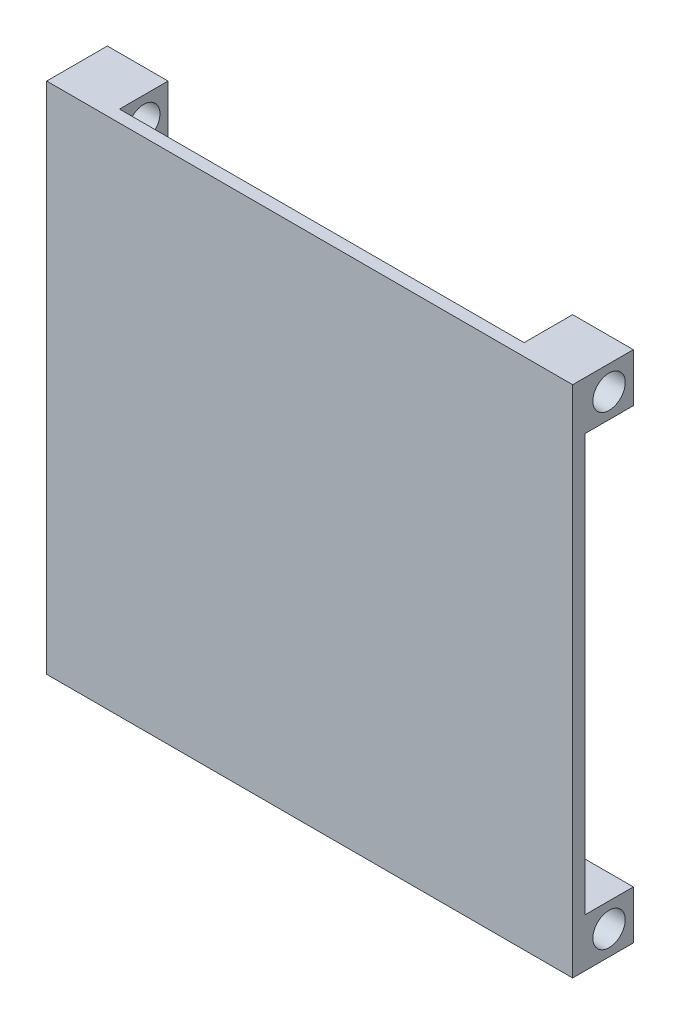
ISO-10303-21;
HEADER;
FILE_DESCRIPTION(('STEP AP214'),'2;1');
FILE_NAME('part.step','',(''),(''),'','','');
FILE_SCHEMA(('AUTOMOTIVE_DESIGN { 1 0 10303 214 1 1 1 1 }'));
ENDSEC;
DATA;
#1=APPLICATION_CONTEXT('core data for automotive mechanical design processes');
#2=APPLICATION_PROTOCOL_DEFINITION('international standard','automotive_design',2000,#1);
#3=PRODUCT_CONTEXT('',#1,'mechanical');
#4=PRODUCT('Part','Part','',(#3));
#5=PRODUCT_RELATED_PRODUCT_CATEGORY('part','',(#4));
#6=PRODUCT_DEFINITION_FORMATION('','',#4);
#7=PRODUCT_DEFINITION_CONTEXT('part definition',#1,'design');
#8=PRODUCT_DEFINITION('design','',#6,#7);
#9=PRODUCT_DEFINITION_SHAPE('','',#8);
#10=(LENGTH_UNIT() NAMED_UNIT(*) SI_UNIT(.MILLI.,.METRE.));
#11=(NAMED_UNIT(*) PLANE_ANGLE_UNIT() SI_UNIT($,.RADIAN.));
#12=(NAMED_UNIT(*) SI_UNIT($,.STERADIAN.) SOLID_ANGLE_UNIT());
#13=UNCERTAINTY_MEASURE_WITH_UNIT(LENGTH_MEASURE(1.E-05),#10,'distance_accuracy_value','');
#14=(GEOMETRIC_REPRESENTATION_CONTEXT(3) GLOBAL_UNCERTAINTY_ASSIGNED_CONTEXT((#13)) GLOBAL_UNIT_ASSIGNED_CONTEXT((#10,
#11,#12)) REPRESENTATION_CONTEXT('',''));
#15=CARTESIAN_POINT('',(0.,0.,0.));
#16=DIRECTION('',(0.,0.,1.));
#17=DIRECTION('',(1.,0.,0.));
#18=AXIS2_PLACEMENT_3D('',#15,#16,#17);
#19=CARTESIAN_POINT('',(-130.,127.,-12.));
#20=DIRECTION('',(0.,0.,-1.));
#21=DIRECTION('',(0.,1.,0.));
#22=AXIS2_PLACEMENT_3D('',#19,#20,#21);
#23=PLANE('',#22);
#24=DIRECTION('',(0.,1.,0.));
#25=VECTOR('',#24,1.);
#26=CARTESIAN_POINT('',(-115.,-33.,-12.));
#27=LINE('',#26,#25);
#28=CARTESIAN_POINT('',(-115.,115.,-12.));
#29=VERTEX_POINT('',#28);
#30=CARTESIAN_POINT('',(-115.,127.,-12.));
#31=VERTEX_POINT('',#30);
#32=EDGE_CURVE('E167',#29,#31,#27,.T.);
#33=ORIENTED_EDGE('',*,*,#32,.F.);
#34=DIRECTION('',(1.,0.,0.));
#35=VECTOR('',#34,1.);
#36=CARTESIAN_POINT('',(-130.,115.,-12.));
#37=LINE('',#36,#35);
#38=CARTESIAN_POINT('',(-130.,115.,-12.));
#39=VERTEX_POINT('',#38);
#40=EDGE_CURVE('E256',#39,#29,#37,.T.);
#41=ORIENTED_EDGE('',*,*,#40,.F.);
#42=DIRECTION('',(0.,1.,0.));
#43=VECTOR('',#42,1.);
#44=CARTESIAN_POINT('',(-130.,127.,-12.));
#45=LINE('',#44,#43);
#46=CARTESIAN_POINT('',(-130.,127.,-12.));
#47=VERTEX_POINT('',#46);
#48=EDGE_CURVE('E245',#39,#47,#45,.T.);
#49=ORIENTED_EDGE('',*,*,#48,.T.);
#50=DIRECTION('',(1.,0.,0.));
#51=VECTOR('',#50,1.);
#52=CARTESIAN_POINT('',(-130.,127.,-12.));
#53=LINE('',#52,#51);
#54=EDGE_CURVE('E252',#47,#31,#53,.T.);
#55=ORIENTED_EDGE('',*,*,#54,.T.);
#56=EDGE_LOOP('',(#33,#41,#49,#55));
#57=FACE_BOUND('',#56,.T.);
#58=ADVANCED_FACE('F34',(#57),#23,.T.);
#59=CARTESIAN_POINT('',(-130.,115.,0.));
#60=DIRECTION('',(0.,-1.,0.));
#61=DIRECTION('',(0.,0.,-1.));
#62=AXIS2_PLACEMENT_3D('',#59,#60,#61);
#63=PLANE('',#62);
#64=DIRECTION('',(0.,0.,-1.));
#65=VECTOR('',#64,1.);
#66=CARTESIAN_POINT('',(-115.,115.,0.));
#67=LINE('',#66,#65);
#68=CARTESIAN_POINT('',(-115.,115.,0.));
#69=VERTEX_POINT('',#68);
#70=EDGE_CURVE('E201',#69,#29,#67,.T.);
#71=ORIENTED_EDGE('',*,*,#70,.F.);
#72=DIRECTION('',(1.,0.,0.));
#73=VECTOR('',#72,1.);
#74=CARTESIAN_POINT('',(-130.,115.,0.));
#75=LINE('',#74,#73);
#76=CARTESIAN_POINT('',(-130.,115.,0.));
#77=VERTEX_POINT('',#76);
#78=EDGE_CURVE('E156',#77,#69,#75,.T.);
#79=ORIENTED_EDGE('',*,*,#78,.F.);
#80=DIRECTION('',(0.,0.,-1.));
#81=VECTOR('',#80,1.);
#82=CARTESIAN_POINT('',(-130.,115.,0.));
#83=LINE('',#82,#81);
#84=EDGE_CURVE('E248',#77,#39,#83,.T.);
#85=ORIENTED_EDGE('',*,*,#84,.T.);
#86=ORIENTED_EDGE('',*,*,#40,.T.);
#87=EDGE_LOOP('',(#71,#79,#85,#86));
#88=FACE_BOUND('',#87,.T.);
#89=ADVANCED_FACE('F325',(#88),#63,.T.);
#90=CARTESIAN_POINT('',(-130.,121.,-6.));
#91=DIRECTION('',(1.,0.,0.));
#92=DIRECTION('',(0.,0.,-1.));
#93=AXIS2_PLACEMENT_3D('',#90,#91,#92);
#94=CYLINDRICAL_SURFACE('',#93,4.00000000000001);
#95=CARTESIAN_POINT('',(-115.,121.,-6.));
#96=DIRECTION('',(-1.,0.,0.));
#97=DIRECTION('',(0.,0.,1.));
#98=AXIS2_PLACEMENT_3D('',#95,#96,#97);
#99=CIRCLE('',#98,4.00000000000001);
#100=CARTESIAN_POINT('',(-115.,121.,-1.99999999999999));
#101=VERTEX_POINT('',#100);
#102=EDGE_CURVE('E198',#101,#101,#99,.F.);
#103=ORIENTED_EDGE('',*,*,#102,.T.);
#104=EDGE_LOOP('',(#103));
#105=FACE_BOUND('',#104,.T.);
#106=CARTESIAN_POINT('',(-130.,121.,-6.));
#107=DIRECTION('',(1.,0.,0.));
#108=DIRECTION('',(0.,0.,-1.));
#109=AXIS2_PLACEMENT_3D('',#106,#107,#108);
#110=CIRCLE('',#109,4.00000000000001);
#111=CARTESIAN_POINT('',(-130.,121.,-10.));
#112=VERTEX_POINT('',#111);
#113=EDGE_CURVE('E239',#112,#112,#110,.T.);
#114=ORIENTED_EDGE('',*,*,#113,.F.);
#115=EDGE_LOOP('',(#114));
#116=FACE_BOUND('',#115,.T.);
#117=ADVANCED_FACE('F375',(#105,#116),#94,.F.);
#118=CARTESIAN_POINT('',(-130.,12.,0.));
#119=DIRECTION('',(0.,1.,0.));
#120=DIRECTION('',(0.,0.,1.));
#121=AXIS2_PLACEMENT_3D('',#118,#119,#120);
#122=PLANE('',#121);
#123=DIRECTION('',(0.,0.,1.));
#124=VECTOR('',#123,1.);
#125=CARTESIAN_POINT('',(-115.,12.,0.));
#126=LINE('',#125,#124);
#127=CARTESIAN_POINT('',(-115.,12.,-12.));
#128=VERTEX_POINT('',#127);
#129=CARTESIAN_POINT('',(-115.,12.,0.));
#130=VERTEX_POINT('',#129);
#131=EDGE_CURVE('E196',#128,#130,#126,.T.);
#132=ORIENTED_EDGE('',*,*,#131,.F.);
#133=DIRECTION('',(1.,0.,0.));
#134=VECTOR('',#133,1.);
#135=CARTESIAN_POINT('',(-130.,12.,-12.));
#136=LINE('',#135,#134);
#137=CARTESIAN_POINT('',(-130.,12.,-12.));
#138=VERTEX_POINT('',#137);
#139=EDGE_CURVE('E232',#138,#128,#136,.T.);
#140=ORIENTED_EDGE('',*,*,#139,.F.);
#141=DIRECTION('',(0.,0.,1.));
#142=VECTOR('',#141,1.);
#143=CARTESIAN_POINT('',(-130.,12.,0.));
#144=LINE('',#143,#142);
#145=CARTESIAN_POINT('',(-130.,12.,0.));
#146=VERTEX_POINT('',#145);
#147=EDGE_CURVE('E219',#138,#146,#144,.T.);
#148=ORIENTED_EDGE('',*,*,#147,.T.);
#149=DIRECTION('',(1.,0.,0.));
#150=VECTOR('',#149,1.);
#151=CARTESIAN_POINT('',(-130.,12.,0.));
#152=LINE('',#151,#150);
#153=EDGE_CURVE('E227',#146,#130,#152,.T.);
#154=ORIENTED_EDGE('',*,*,#153,.T.);
#155=EDGE_LOOP('',(#132,#140,#148,#154));
#156=FACE_BOUND('',#155,.T.);
#157=ADVANCED_FACE('F332',(#156),#122,.T.);
#158=CARTESIAN_POINT('',(-130.,0.,-12.));
#159=DIRECTION('',(0.,0.,-1.));
#160=DIRECTION('',(0.,1.,0.));
#161=AXIS2_PLACEMENT_3D('',#158,#159,#160);
#162=PLANE('',#161);
#163=CARTESIAN_POINT('',(-115.,0.,-12.));
#164=VERTEX_POINT('',#163);
#165=EDGE_CURVE('E178',#164,#128,#27,.T.);
#166=ORIENTED_EDGE('',*,*,#165,.F.);
#167=DIRECTION('',(1.,0.,0.));
#168=VECTOR('',#167,1.);
#169=CARTESIAN_POINT('',(-130.,0.,-12.));
#170=LINE('',#169,#168);
#171=CARTESIAN_POINT('',(-130.,0.,-12.));
#172=VERTEX_POINT('',#171);
#173=EDGE_CURVE('E236',#172,#164,#170,.T.);
#174=ORIENTED_EDGE('',*,*,#173,.F.);
#175=DIRECTION('',(0.,1.,0.));
#176=VECTOR('',#175,1.);
#177=CARTESIAN_POINT('',(-130.,0.,-12.));
#178=LINE('',#177,#176);
#179=EDGE_CURVE('E216',#172,#138,#178,.T.);
#180=ORIENTED_EDGE('',*,*,#179,.T.);
#181=ORIENTED_EDGE('',*,*,#139,.T.);
#182=EDGE_LOOP('',(#166,#174,#180,#181));
#183=FACE_BOUND('',#182,.T.);
#184=ADVANCED_FACE('F336',(#183),#162,.T.);
#185=CARTESIAN_POINT('',(-130.,6.00000000000001,-6.));
#186=DIRECTION('',(1.,0.,0.));
#187=DIRECTION('',(0.,0.,-1.));
#188=AXIS2_PLACEMENT_3D('',#185,#186,#187);
#189=CYLINDRICAL_SURFACE('',#188,4.);
#190=CARTESIAN_POINT('',(-115.,6.00000000000001,-6.));
#191=DIRECTION('',(-1.,0.,0.));
#192=DIRECTION('',(0.,0.,1.));
#193=AXIS2_PLACEMENT_3D('',#190,#191,#192);
#194=CIRCLE('',#193,4.);
#195=CARTESIAN_POINT('',(-115.,6.00000000000001,-2.));
#196=VERTEX_POINT('',#195);
#197=EDGE_CURVE('E195',#196,#196,#194,.F.);
#198=ORIENTED_EDGE('',*,*,#197,.T.);
#199=EDGE_LOOP('',(#198));
#200=FACE_BOUND('',#199,.T.);
#201=CARTESIAN_POINT('',(-130.,6.00000000000001,-6.));
#202=DIRECTION('',(1.,0.,0.));
#203=DIRECTION('',(0.,0.,1.));
#204=AXIS2_PLACEMENT_3D('',#201,#202,#203);
#205=CIRCLE('',#204,4.);
#206=CARTESIAN_POINT('',(-130.,6.00000000000001,-2.));
#207=VERTEX_POINT('',#206);
#208=EDGE_CURVE('E210',#207,#207,#205,.T.);
#209=ORIENTED_EDGE('',*,*,#208,.F.);
#210=EDGE_LOOP('',(#209));
#211=FACE_BOUND('',#210,.T.);
#212=ADVANCED_FACE('F365',(#200,#211),#189,.F.);
#213=CARTESIAN_POINT('',(0.,0.,3.));
#214=DIRECTION('',(-1.,0.,0.));
#215=DIRECTION('',(0.,0.,1.));
#216=AXIS2_PLACEMENT_3D('',#213,#214,#215);
#217=PLANE('',#216);
#218=DIRECTION('',(0.,0.,-1.));
#219=VECTOR('',#218,1.);
#220=CARTESIAN_POINT('',(0.,0.,3.));
#221=LINE('',#220,#219);
#222=CARTESIAN_POINT('',(0.,0.,3.));
#223=VERTEX_POINT('',#222);
#224=CARTESIAN_POINT('',(0.,0.,-12.));
#225=VERTEX_POINT('',#224);
#226=EDGE_CURVE('E284',#223,#225,#221,.T.);
#227=ORIENTED_EDGE('',*,*,#226,.T.);
#228=DIRECTION('',(0.,1.,0.));
#229=VECTOR('',#228,1.);
#230=CARTESIAN_POINT('',(0.,0.,-12.));
#231=LINE('',#230,#229);
#232=CARTESIAN_POINT('',(0.,12.,-12.));
#233=VERTEX_POINT('',#232);
#234=EDGE_CURVE('E213',#225,#233,#231,.T.);
#235=ORIENTED_EDGE('',*,*,#234,.T.);
#236=DIRECTION('',(0.,0.,1.));
#237=VECTOR('',#236,1.);
#238=CARTESIAN_POINT('',(0.,12.,0.));
#239=LINE('',#238,#237);
#240=CARTESIAN_POINT('',(0.,12.,0.));
#241=VERTEX_POINT('',#240);
#242=EDGE_CURVE('E220',#233,#241,#239,.T.);
#243=ORIENTED_EDGE('',*,*,#242,.T.);
#244=DIRECTION('',(0.,1.,0.));
#245=VECTOR('',#244,1.);
#246=CARTESIAN_POINT('',(0.,0.,0.));
#247=LINE('',#246,#245);
#248=CARTESIAN_POINT('',(0.,115.,0.));
#249=VERTEX_POINT('',#248);
#250=EDGE_CURVE('E254',#241,#249,#247,.T.);
#251=ORIENTED_EDGE('',*,*,#250,.T.);
#252=DIRECTION('',(0.,0.,-1.));
#253=VECTOR('',#252,1.);
#254=CARTESIAN_POINT('',(0.,115.,0.));
#255=LINE('',#254,#253);
#256=CARTESIAN_POINT('',(0.,115.,-12.));
#257=VERTEX_POINT('',#256);
#258=EDGE_CURVE('E242',#249,#257,#255,.T.);
#259=ORIENTED_EDGE('',*,*,#258,.T.);
#260=DIRECTION('',(0.,1.,0.));
#261=VECTOR('',#260,1.);
#262=CARTESIAN_POINT('',(0.,127.,-12.));
#263=LINE('',#262,#261);
#264=CARTESIAN_POINT('',(0.,127.,-12.));
#265=VERTEX_POINT('',#264);
#266=EDGE_CURVE('E249',#257,#265,#263,.T.);
#267=ORIENTED_EDGE('',*,*,#266,.T.);
#268=DIRECTION('',(0.,0.,-1.));
#269=VECTOR('',#268,1.);
#270=CARTESIAN_POINT('',(0.,127.,3.));
#271=LINE('',#270,#269);
#272=CARTESIAN_POINT('',(0.,127.,3.));
#273=VERTEX_POINT('',#272);
#274=EDGE_CURVE('E12',#273,#265,#271,.T.);
#275=ORIENTED_EDGE('',*,*,#274,.F.);
#276=DIRECTION('',(0.,1.,0.));
#277=VECTOR('',#276,1.);
#278=CARTESIAN_POINT('',(0.,0.,3.));
#279=LINE('',#278,#277);
#280=EDGE_CURVE('E261',#223,#273,#279,.T.);
#281=ORIENTED_EDGE('',*,*,#280,.F.);
#282=EDGE_LOOP('',(#227,#235,#243,#251,#259,#267,#275,#281));
#283=FACE_BOUND('',#282,.T.);
#284=CARTESIAN_POINT('',(0.,121.,-6.));
#285=DIRECTION('',(1.,0.,0.));
#286=DIRECTION('',(0.,0.,-1.));
#287=AXIS2_PLACEMENT_3D('',#284,#285,#286);
#288=CIRCLE('',#287,4.00000000000001);
#289=CARTESIAN_POINT('',(0.,121.,-10.));
#290=VERTEX_POINT('',#289);
#291=EDGE_CURVE('E230',#290,#290,#288,.T.);
#292=ORIENTED_EDGE('',*,*,#291,.F.);
#293=EDGE_LOOP('',(#292));
#294=FACE_BOUND('',#293,.T.);
#295=CARTESIAN_POINT('',(0.,6.00000000000001,-6.));
#296=DIRECTION('',(1.,0.,0.));
#297=DIRECTION('',(0.,0.,1.));
#298=AXIS2_PLACEMENT_3D('',#295,#296,#297);
#299=CIRCLE('',#298,4.);
#300=CARTESIAN_POINT('',(0.,6.00000000000001,-2.));
#301=VERTEX_POINT('',#300);
#302=EDGE_CURVE('E209',#301,#301,#299,.T.);
#303=ORIENTED_EDGE('',*,*,#302,.F.);
#304=EDGE_LOOP('',(#303));
#305=FACE_BOUND('',#304,.T.);
#306=ADVANCED_FACE('F36',(#283,#294,#305),#217,.F.);
#307=CARTESIAN_POINT('',(0.,127.,3.));
#308=DIRECTION('',(0.,-1.,0.));
#309=DIRECTION('',(1.,0.,0.));
#310=AXIS2_PLACEMENT_3D('',#307,#308,#309);
#311=PLANE('',#310);
#312=DIRECTION('',(1.,0.,0.));
#313=VECTOR('',#312,1.);
#314=CARTESIAN_POINT('',(-115.,127.,0.));
#315=LINE('',#314,#313);
#316=CARTESIAN_POINT('',(-115.,127.,0.));
#317=VERTEX_POINT('',#316);
#318=CARTESIAN_POINT('',(-15.,127.,0.));
#319=VERTEX_POINT('',#318);
#320=EDGE_CURVE('E153',#317,#319,#315,.T.);
#321=ORIENTED_EDGE('',*,*,#320,.F.);
#322=DIRECTION('',(0.,0.,1.));
#323=VECTOR('',#322,1.);
#324=CARTESIAN_POINT('',(-115.,127.,-12.));
#325=LINE('',#324,#323);
#326=EDGE_CURVE('E163',#31,#317,#325,.T.);
#327=ORIENTED_EDGE('',*,*,#326,.F.);
#328=ORIENTED_EDGE('',*,*,#54,.F.);
#329=DIRECTION('',(0.,0.,-1.));
#330=VECTOR('',#329,1.);
#331=CARTESIAN_POINT('',(-130.,127.,3.));
#332=LINE('',#331,#330);
#333=CARTESIAN_POINT('',(-130.,127.,3.));
#334=VERTEX_POINT('',#333);
#335=EDGE_CURVE('E44',#334,#47,#332,.T.);
#336=ORIENTED_EDGE('',*,*,#335,.F.);
#337=DIRECTION('',(-1.,0.,0.));
#338=VECTOR('',#337,1.);
#339=CARTESIAN_POINT('',(0.,127.,3.));
#340=LINE('',#339,#338);
#341=EDGE_CURVE('E305',#273,#334,#340,.T.);
#342=ORIENTED_EDGE('',*,*,#341,.F.);
#343=ORIENTED_EDGE('',*,*,#274,.T.);
#344=CARTESIAN_POINT('',(-15.,127.,-12.));
#345=VERTEX_POINT('',#344);
#346=EDGE_CURVE('E255',#345,#265,#53,.T.);
#347=ORIENTED_EDGE('',*,*,#346,.F.);
#348=DIRECTION('',(0.,0.,-1.));
#349=VECTOR('',#348,1.);
#350=CARTESIAN_POINT('',(-15.,127.,-12.));
#351=LINE('',#350,#349);
#352=EDGE_CURVE('E160',#319,#345,#351,.T.);
#353=ORIENTED_EDGE('',*,*,#352,.F.);
#354=EDGE_LOOP('',(#321,#327,#328,#336,#342,#343,#347,#353));
#355=FACE_BOUND('',#354,.T.);
#356=ADVANCED_FACE('F172',(#355),#311,.F.);
#357=CARTESIAN_POINT('',(-130.,0.,3.));
#358=DIRECTION('',(1.,0.,0.));
#359=DIRECTION('',(0.,0.,-1.));
#360=AXIS2_PLACEMENT_3D('',#357,#358,#359);
#361=PLANE('',#360);
#362=ORIENTED_EDGE('',*,*,#335,.T.);
#363=ORIENTED_EDGE('',*,*,#48,.F.);
#364=ORIENTED_EDGE('',*,*,#84,.F.);
#365=DIRECTION('',(0.,-1.,0.));
#366=VECTOR('',#365,1.);
#367=CARTESIAN_POINT('',(-130.,0.,0.));
#368=LINE('',#367,#366);
#369=EDGE_CURVE('E276',#77,#146,#368,.T.);
#370=ORIENTED_EDGE('',*,*,#369,.T.);
#371=ORIENTED_EDGE('',*,*,#147,.F.);
#372=ORIENTED_EDGE('',*,*,#179,.F.);
#373=DIRECTION('',(0.,0.,-1.));
#374=VECTOR('',#373,1.);
#375=CARTESIAN_POINT('',(-130.,0.,3.));
#376=LINE('',#375,#374);
#377=CARTESIAN_POINT('',(-130.,0.,3.));
#378=VERTEX_POINT('',#377);
#379=EDGE_CURVE('E315',#378,#172,#376,.T.);
#380=ORIENTED_EDGE('',*,*,#379,.F.);
#381=DIRECTION('',(0.,-1.,0.));
#382=VECTOR('',#381,1.);
#383=CARTESIAN_POINT('',(-130.,0.,3.));
#384=LINE('',#383,#382);
#385=EDGE_CURVE('E311',#334,#378,#384,.T.);
#386=ORIENTED_EDGE('',*,*,#385,.F.);
#387=EDGE_LOOP('',(#362,#363,#364,#370,#371,#372,#380,#386));
#388=FACE_BOUND('',#387,.T.);
#389=ORIENTED_EDGE('',*,*,#113,.T.);
#390=EDGE_LOOP('',(#389));
#391=FACE_BOUND('',#390,.T.);
#392=ORIENTED_EDGE('',*,*,#208,.T.);
#393=EDGE_LOOP('',(#392));
#394=FACE_BOUND('',#393,.T.);
#395=ADVANCED_FACE('F320',(#388,#391,#394),#361,.F.);
#396=CARTESIAN_POINT('',(0.,0.,3.));
#397=DIRECTION('',(0.,1.,0.));
#398=DIRECTION('',(-1.,0.,0.));
#399=AXIS2_PLACEMENT_3D('',#396,#397,#398);
#400=PLANE('',#399);
#401=ORIENTED_EDGE('',*,*,#173,.T.);
#402=DIRECTION('',(0.,0.,1.));
#403=VECTOR('',#402,1.);
#404=CARTESIAN_POINT('',(-115.,0.,3.));
#405=LINE('',#404,#403);
#406=CARTESIAN_POINT('',(-115.,0.,0.));
#407=VERTEX_POINT('',#406);
#408=EDGE_CURVE('E203',#164,#407,#405,.T.);
#409=ORIENTED_EDGE('',*,*,#408,.T.);
#410=DIRECTION('',(1.,0.,0.));
#411=VECTOR('',#410,1.);
#412=CARTESIAN_POINT('',(0.,0.,0.));
#413=LINE('',#412,#411);
#414=CARTESIAN_POINT('',(-15.,0.,0.));
#415=VERTEX_POINT('',#414);
#416=EDGE_CURVE('E206',#407,#415,#413,.T.);
#417=ORIENTED_EDGE('',*,*,#416,.T.);
#418=DIRECTION('',(0.,0.,-1.));
#419=VECTOR('',#418,1.);
#420=CARTESIAN_POINT('',(-15.,0.,3.));
#421=LINE('',#420,#419);
#422=CARTESIAN_POINT('',(-15.,0.,-12.));
#423=VERTEX_POINT('',#422);
#424=EDGE_CURVE('E192',#415,#423,#421,.T.);
#425=ORIENTED_EDGE('',*,*,#424,.T.);
#426=EDGE_CURVE('E222',#423,#225,#170,.T.);
#427=ORIENTED_EDGE('',*,*,#426,.T.);
#428=ORIENTED_EDGE('',*,*,#226,.F.);
#429=DIRECTION('',(1.,0.,0.));
#430=VECTOR('',#429,1.);
#431=CARTESIAN_POINT('',(0.,0.,3.));
#432=LINE('',#431,#430);
#433=EDGE_CURVE('E280',#378,#223,#432,.T.);
#434=ORIENTED_EDGE('',*,*,#433,.F.);
#435=ORIENTED_EDGE('',*,*,#379,.T.);
#436=EDGE_LOOP('',(#401,#409,#417,#425,#427,#428,#434,#435));
#437=FACE_BOUND('',#436,.T.);
#438=ADVANCED_FACE('F337',(#437),#400,.F.);
#439=CARTESIAN_POINT('',(0.,127.,3.));
#440=DIRECTION('',(0.,0.,1.));
#441=DIRECTION('',(1.,0.,0.));
#442=AXIS2_PLACEMENT_3D('',#439,#440,#441);
#443=PLANE('',#442);
#444=ORIENTED_EDGE('',*,*,#280,.T.);
#445=ORIENTED_EDGE('',*,*,#341,.T.);
#446=ORIENTED_EDGE('',*,*,#385,.T.);
#447=ORIENTED_EDGE('',*,*,#433,.T.);
#448=EDGE_LOOP('',(#444,#445,#446,#447));
#449=FACE_BOUND('',#448,.T.);
#450=ADVANCED_FACE('F382',(#449),#443,.T.);
#451=CARTESIAN_POINT('',(0.,127.,0.));
#452=DIRECTION('',(0.,0.,1.));
#453=DIRECTION('',(1.,0.,0.));
#454=AXIS2_PLACEMENT_3D('',#451,#452,#453);
#455=PLANE('',#454);
#456=CARTESIAN_POINT('',(-15.,12.,0.));
#457=VERTEX_POINT('',#456);
#458=EDGE_CURVE('E231',#457,#241,#152,.T.);
#459=ORIENTED_EDGE('',*,*,#458,.F.);
#460=DIRECTION('',(0.,1.,0.));
#461=VECTOR('',#460,1.);
#462=CARTESIAN_POINT('',(-15.,-33.,0.));
#463=LINE('',#462,#461);
#464=EDGE_CURVE('E183',#415,#457,#463,.T.);
#465=ORIENTED_EDGE('',*,*,#464,.F.);
#466=ORIENTED_EDGE('',*,*,#416,.F.);
#467=DIRECTION('',(0.,1.,0.));
#468=VECTOR('',#467,1.);
#469=CARTESIAN_POINT('',(-115.,-33.,0.));
#470=LINE('',#469,#468);
#471=EDGE_CURVE('E159',#407,#130,#470,.T.);
#472=ORIENTED_EDGE('',*,*,#471,.T.);
#473=ORIENTED_EDGE('',*,*,#153,.F.);
#474=ORIENTED_EDGE('',*,*,#369,.F.);
#475=ORIENTED_EDGE('',*,*,#78,.T.);
#476=EDGE_CURVE('E148',#69,#317,#470,.T.);
#477=ORIENTED_EDGE('',*,*,#476,.T.);
#478=ORIENTED_EDGE('',*,*,#320,.T.);
#479=CARTESIAN_POINT('',(-15.,115.,0.));
#480=VERTEX_POINT('',#479);
#481=EDGE_CURVE('E52',#480,#319,#463,.T.);
#482=ORIENTED_EDGE('',*,*,#481,.F.);
#483=EDGE_CURVE('E38',#480,#249,#75,.T.);
#484=ORIENTED_EDGE('',*,*,#483,.T.);
#485=ORIENTED_EDGE('',*,*,#250,.F.);
#486=EDGE_LOOP('',(#459,#465,#466,#472,#473,#474,#475,#477,#478,#482,#484,#485));
#487=FACE_BOUND('',#486,.T.);
#488=ADVANCED_FACE('F151',(#487),#455,.F.);
#489=DIRECTION('',(0.,1.,0.));
#490=VECTOR('',#489,1.);
#491=CARTESIAN_POINT('',(-15.,-33.,-12.));
#492=LINE('',#491,#490);
#493=CARTESIAN_POINT('',(-15.,115.,-12.));
#494=VERTEX_POINT('',#493);
#495=EDGE_CURVE('E180',#494,#345,#492,.T.);
#496=ORIENTED_EDGE('',*,*,#495,.T.);
#497=ORIENTED_EDGE('',*,*,#346,.T.);
#498=ORIENTED_EDGE('',*,*,#266,.F.);
#499=EDGE_CURVE('E258',#494,#257,#37,.T.);
#500=ORIENTED_EDGE('',*,*,#499,.F.);
#501=EDGE_LOOP('',(#496,#497,#498,#500));
#502=FACE_BOUND('',#501,.T.);
#503=ADVANCED_FACE('F303',(#502),#23,.T.);
#504=DIRECTION('',(0.,0.,1.));
#505=VECTOR('',#504,1.);
#506=CARTESIAN_POINT('',(-15.,115.,0.));
#507=LINE('',#506,#505);
#508=EDGE_CURVE('E190',#494,#480,#507,.T.);
#509=ORIENTED_EDGE('',*,*,#508,.F.);
#510=ORIENTED_EDGE('',*,*,#499,.T.);
#511=ORIENTED_EDGE('',*,*,#258,.F.);
#512=ORIENTED_EDGE('',*,*,#483,.F.);
#513=EDGE_LOOP('',(#509,#510,#511,#512));
#514=FACE_BOUND('',#513,.T.);
#515=ADVANCED_FACE('F300',(#514),#63,.T.);
#516=CARTESIAN_POINT('',(-15.,121.,-6.));
#517=DIRECTION('',(1.,0.,0.));
#518=DIRECTION('',(0.,0.,-1.));
#519=AXIS2_PLACEMENT_3D('',#516,#517,#518);
#520=CIRCLE('',#519,4.00000000000001);
#521=CARTESIAN_POINT('',(-15.,121.,-10.));
#522=VERTEX_POINT('',#521);
#523=EDGE_CURVE('E186',#522,#522,#520,.F.);
#524=ORIENTED_EDGE('',*,*,#523,.T.);
#525=EDGE_LOOP('',(#524));
#526=FACE_BOUND('',#525,.T.);
#527=ORIENTED_EDGE('',*,*,#291,.T.);
#528=EDGE_LOOP('',(#527));
#529=FACE_BOUND('',#528,.T.);
#530=ADVANCED_FACE('F366',(#526,#529),#94,.F.);
#531=DIRECTION('',(0.,0.,-1.));
#532=VECTOR('',#531,1.);
#533=CARTESIAN_POINT('',(-15.,12.,0.));
#534=LINE('',#533,#532);
#535=CARTESIAN_POINT('',(-15.,12.,-12.));
#536=VERTEX_POINT('',#535);
#537=EDGE_CURVE('E60',#457,#536,#534,.T.);
#538=ORIENTED_EDGE('',*,*,#537,.F.);
#539=ORIENTED_EDGE('',*,*,#458,.T.);
#540=ORIENTED_EDGE('',*,*,#242,.F.);
#541=EDGE_CURVE('E235',#536,#233,#136,.T.);
#542=ORIENTED_EDGE('',*,*,#541,.F.);
#543=EDGE_LOOP('',(#538,#539,#540,#542));
#544=FACE_BOUND('',#543,.T.);
#545=ADVANCED_FACE('F353',(#544),#122,.T.);
#546=EDGE_CURVE('E179',#423,#536,#492,.T.);
#547=ORIENTED_EDGE('',*,*,#546,.T.);
#548=ORIENTED_EDGE('',*,*,#541,.T.);
#549=ORIENTED_EDGE('',*,*,#234,.F.);
#550=ORIENTED_EDGE('',*,*,#426,.F.);
#551=EDGE_LOOP('',(#547,#548,#549,#550));
#552=FACE_BOUND('',#551,.T.);
#553=ADVANCED_FACE('F356',(#552),#162,.T.);
#554=CARTESIAN_POINT('',(-15.,6.00000000000001,-6.));
#555=DIRECTION('',(1.,0.,0.));
#556=DIRECTION('',(0.,0.,-1.));
#557=AXIS2_PLACEMENT_3D('',#554,#555,#556);
#558=CIRCLE('',#557,4.);
#559=CARTESIAN_POINT('',(-15.,6.00000000000001,-10.));
#560=VERTEX_POINT('',#559);
#561=EDGE_CURVE('E187',#560,#560,#558,.F.);
#562=ORIENTED_EDGE('',*,*,#561,.T.);
#563=EDGE_LOOP('',(#562));
#564=FACE_BOUND('',#563,.T.);
#565=ORIENTED_EDGE('',*,*,#302,.T.);
#566=EDGE_LOOP('',(#565));
#567=FACE_BOUND('',#566,.T.);
#568=ADVANCED_FACE('F343',(#564,#567),#189,.F.);
#569=CARTESIAN_POINT('',(-15.,-33.,-12.));
#570=DIRECTION('',(1.,0.,0.));
#571=DIRECTION('',(0.,0.,-1.));
#572=AXIS2_PLACEMENT_3D('',#569,#570,#571);
#573=PLANE('',#572);
#574=ORIENTED_EDGE('',*,*,#561,.F.);
#575=EDGE_LOOP('',(#574));
#576=FACE_BOUND('',#575,.T.);
#577=ORIENTED_EDGE('',*,*,#464,.T.);
#578=ORIENTED_EDGE('',*,*,#537,.T.);
#579=ORIENTED_EDGE('',*,*,#546,.F.);
#580=ORIENTED_EDGE('',*,*,#424,.F.);
#581=EDGE_LOOP('',(#577,#578,#579,#580));
#582=FACE_BOUND('',#581,.T.);
#583=ADVANCED_FACE('F346',(#576,#582),#573,.F.);
#584=CARTESIAN_POINT('',(-115.,-33.,-12.));
#585=DIRECTION('',(-1.,0.,0.));
#586=DIRECTION('',(0.,0.,1.));
#587=AXIS2_PLACEMENT_3D('',#584,#585,#586);
#588=PLANE('',#587);
#589=ORIENTED_EDGE('',*,*,#197,.F.);
#590=EDGE_LOOP('',(#589));
#591=FACE_BOUND('',#590,.T.);
#592=ORIENTED_EDGE('',*,*,#165,.T.);
#593=ORIENTED_EDGE('',*,*,#131,.T.);
#594=ORIENTED_EDGE('',*,*,#471,.F.);
#595=ORIENTED_EDGE('',*,*,#408,.F.);
#596=EDGE_LOOP('',(#592,#593,#594,#595));
#597=FACE_BOUND('',#596,.T.);
#598=ADVANCED_FACE('F339',(#591,#597),#588,.F.);
#599=ORIENTED_EDGE('',*,*,#70,.T.);
#600=ORIENTED_EDGE('',*,*,#32,.T.);
#601=ORIENTED_EDGE('',*,*,#326,.T.);
#602=ORIENTED_EDGE('',*,*,#476,.F.);
#603=EDGE_LOOP('',(#599,#600,#601,#602));
#604=FACE_BOUND('',#603,.T.);
#605=ORIENTED_EDGE('',*,*,#102,.F.);
#606=EDGE_LOOP('',(#605));
#607=FACE_BOUND('',#606,.T.);
#608=ADVANCED_FACE('F164',(#604,#607),#588,.F.);
#609=ORIENTED_EDGE('',*,*,#508,.T.);
#610=ORIENTED_EDGE('',*,*,#481,.T.);
#611=ORIENTED_EDGE('',*,*,#352,.T.);
#612=ORIENTED_EDGE('',*,*,#495,.F.);
#613=EDGE_LOOP('',(#609,#610,#611,#612));
#614=FACE_BOUND('',#613,.T.);
#615=ORIENTED_EDGE('',*,*,#523,.F.);
#616=EDGE_LOOP('',(#615));
#617=FACE_BOUND('',#616,.T.);
#618=ADVANCED_FACE('F349',(#614,#617),#573,.F.);
#619=CLOSED_SHELL('',(#58,#89,#117,#157,#184,#212,#306,#356,#395,#438,#450,#488,#503,#515,#530,
#545,#553,#568,#583,#598,#608,#618));
#620=MANIFOLD_SOLID_BREP('B2',#619);
#621=ADVANCED_BREP_SHAPE_REPRESENTATION('',(#18,#620),#14);
#622=SHAPE_DEFINITION_REPRESENTATION(#9,#621);
ENDSEC;
END-ISO-10303-21;
